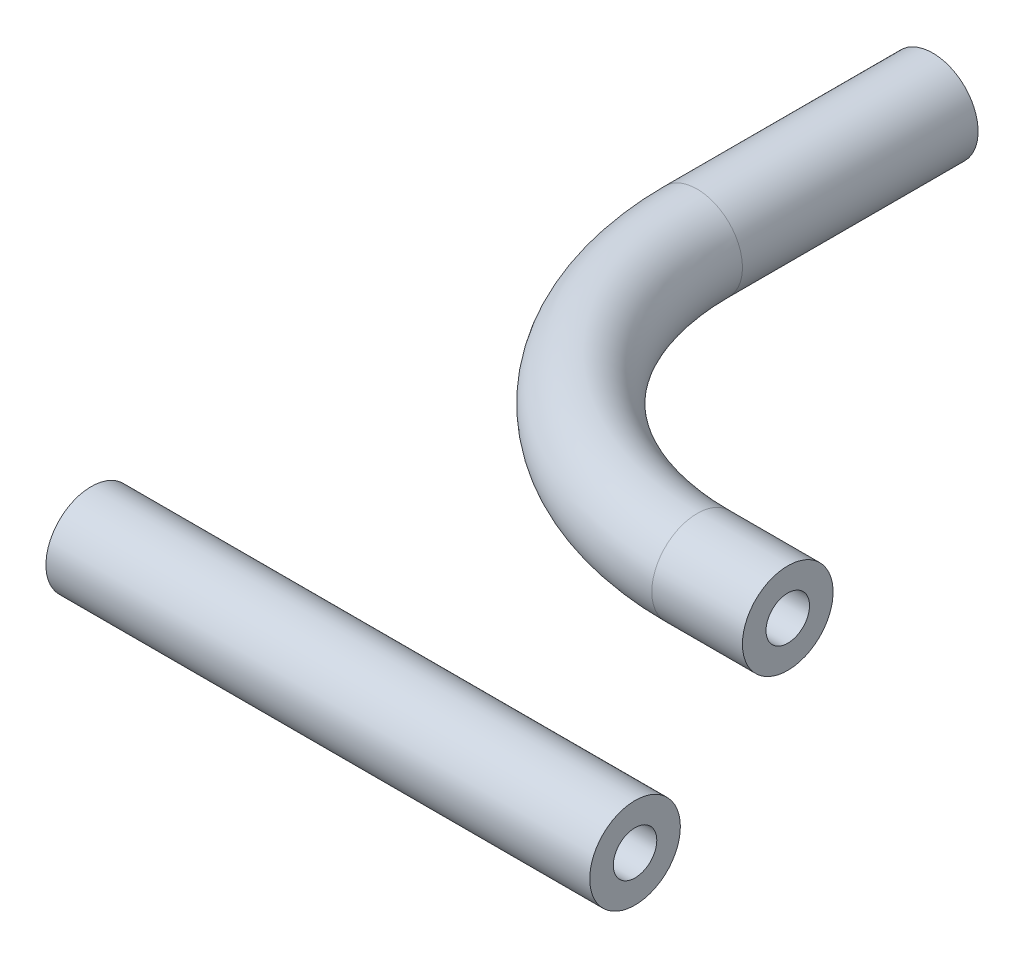
ISO-10303-21;
HEADER;
FILE_DESCRIPTION(('STEP AP214'),'2;1');
FILE_NAME('part.step','',(''),(''),'','','');
FILE_SCHEMA(('AUTOMOTIVE_DESIGN { 1 0 10303 214 1 1 1 1 }'));
ENDSEC;
DATA;
#1=APPLICATION_CONTEXT('core data for automotive mechanical design processes');
#2=APPLICATION_PROTOCOL_DEFINITION('international standard','automotive_design',2000,#1);
#3=PRODUCT_CONTEXT('',#1,'mechanical');
#4=PRODUCT('Part','Part','',(#3));
#5=PRODUCT_RELATED_PRODUCT_CATEGORY('part','',(#4));
#6=PRODUCT_DEFINITION_FORMATION('','',#4);
#7=PRODUCT_DEFINITION_CONTEXT('part definition',#1,'design');
#8=PRODUCT_DEFINITION('design','',#6,#7);
#9=PRODUCT_DEFINITION_SHAPE('','',#8);
#10=(LENGTH_UNIT() NAMED_UNIT(*) SI_UNIT(.MILLI.,.METRE.));
#11=(NAMED_UNIT(*) PLANE_ANGLE_UNIT() SI_UNIT($,.RADIAN.));
#12=(NAMED_UNIT(*) SI_UNIT($,.STERADIAN.) SOLID_ANGLE_UNIT());
#13=UNCERTAINTY_MEASURE_WITH_UNIT(LENGTH_MEASURE(1.E-05),#10,'distance_accuracy_value','');
#14=(GEOMETRIC_REPRESENTATION_CONTEXT(3) GLOBAL_UNCERTAINTY_ASSIGNED_CONTEXT((#13)) GLOBAL_UNIT_ASSIGNED_CONTEXT((#10,
#11,#12)) REPRESENTATION_CONTEXT('',''));
#15=CARTESIAN_POINT('',(0.,0.,0.));
#16=DIRECTION('',(0.,0.,1.));
#17=DIRECTION('',(1.,0.,0.));
#18=AXIS2_PLACEMENT_3D('',#15,#16,#17);
#19=CARTESIAN_POINT('',(38.1,0.,16.4145448021495));
#20=DIRECTION('',(1.,0.,0.));
#21=DIRECTION('',(0.,0.,-1.));
#22=AXIS2_PLACEMENT_3D('',#19,#20,#21);
#23=PLANE('',#22);
#24=CARTESIAN_POINT('',(38.1,0.,16.4145448021495));
#25=DIRECTION('',(1.,0.,0.));
#26=DIRECTION('',(0.,0.,-1.));
#27=AXIS2_PLACEMENT_3D('',#24,#25,#26);
#28=CIRCLE('',#27,3.175);
#29=CARTESIAN_POINT('',(38.1,0.,13.2395448021495));
#30=VERTEX_POINT('',#29);
#31=EDGE_CURVE('E11',#30,#30,#28,.T.);
#32=ORIENTED_EDGE('',*,*,#31,.T.);
#33=EDGE_LOOP('',(#32));
#34=FACE_BOUND('',#33,.T.);
#35=CARTESIAN_POINT('',(38.1,0.,16.4145448021495));
#36=DIRECTION('',(1.,0.,0.));
#37=DIRECTION('',(0.,0.,-1.));
#38=AXIS2_PLACEMENT_3D('',#35,#36,#37);
#39=CIRCLE('',#38,1.524);
#40=CARTESIAN_POINT('',(38.1,0.,14.8905448021495));
#41=VERTEX_POINT('',#40);
#42=EDGE_CURVE('E52',#41,#41,#39,.T.);
#43=ORIENTED_EDGE('',*,*,#42,.F.);
#44=EDGE_LOOP('',(#43));
#45=FACE_BOUND('',#44,.T.);
#46=ADVANCED_FACE('F41',(#34,#45),#23,.T.);
#47=CARTESIAN_POINT('',(0.,0.,16.4145448021495));
#48=DIRECTION('',(1.,0.,0.));
#49=DIRECTION('',(0.,0.,-1.));
#50=AXIS2_PLACEMENT_3D('',#47,#48,#49);
#51=PLANE('',#50);
#52=CARTESIAN_POINT('',(0.,0.,16.4145448021495));
#53=DIRECTION('',(1.,0.,0.));
#54=DIRECTION('',(0.,0.,-1.));
#55=AXIS2_PLACEMENT_3D('',#52,#53,#54);
#56=CIRCLE('',#55,3.175);
#57=CARTESIAN_POINT('',(0.,0.,13.2395448021495));
#58=VERTEX_POINT('',#57);
#59=EDGE_CURVE('E45',#58,#58,#56,.T.);
#60=ORIENTED_EDGE('',*,*,#59,.F.);
#61=EDGE_LOOP('',(#60));
#62=FACE_BOUND('',#61,.T.);
#63=CARTESIAN_POINT('',(0.,0.,16.4145448021495));
#64=DIRECTION('',(1.,0.,0.));
#65=DIRECTION('',(0.,0.,-1.));
#66=AXIS2_PLACEMENT_3D('',#63,#64,#65);
#67=CIRCLE('',#66,1.524);
#68=CARTESIAN_POINT('',(0.,0.,14.8905448021495));
#69=VERTEX_POINT('',#68);
#70=EDGE_CURVE('E54',#69,#69,#67,.T.);
#71=ORIENTED_EDGE('',*,*,#70,.T.);
#72=EDGE_LOOP('',(#71));
#73=FACE_BOUND('',#72,.T.);
#74=ADVANCED_FACE('F64',(#62,#73),#51,.F.);
#75=CARTESIAN_POINT('',(38.1,0.,16.4145448021495));
#76=DIRECTION('',(-1.,0.,0.));
#77=DIRECTION('',(0.,0.,1.));
#78=AXIS2_PLACEMENT_3D('',#75,#76,#77);
#79=CYLINDRICAL_SURFACE('',#78,3.175);
#80=ORIENTED_EDGE('',*,*,#31,.F.);
#81=EDGE_LOOP('',(#80));
#82=FACE_BOUND('',#81,.T.);
#83=ORIENTED_EDGE('',*,*,#59,.T.);
#84=EDGE_LOOP('',(#83));
#85=FACE_BOUND('',#84,.T.);
#86=ADVANCED_FACE('F43',(#82,#85),#79,.T.);
#87=CARTESIAN_POINT('',(38.1,0.,16.4145448021495));
#88=DIRECTION('',(-1.,0.,0.));
#89=DIRECTION('',(0.,0.,1.));
#90=AXIS2_PLACEMENT_3D('',#87,#88,#89);
#91=CYLINDRICAL_SURFACE('',#90,1.524);
#92=ORIENTED_EDGE('',*,*,#42,.T.);
#93=EDGE_LOOP('',(#92));
#94=FACE_BOUND('',#93,.T.);
#95=ORIENTED_EDGE('',*,*,#70,.F.);
#96=EDGE_LOOP('',(#95));
#97=FACE_BOUND('',#96,.T.);
#98=ADVANCED_FACE('F60',(#94,#97),#91,.F.);
#99=CLOSED_SHELL('',(#46,#74,#86,#98));
#100=MANIFOLD_SOLID_BREP('B2',#99);
#101=CARTESIAN_POINT('',(3.175,0.,-39.37));
#102=DIRECTION('',(0.,0.,1.));
#103=DIRECTION('',(1.,0.,0.));
#104=AXIS2_PLACEMENT_3D('',#101,#102,#103);
#105=CYLINDRICAL_SURFACE('',#104,3.175);
#106=CARTESIAN_POINT('',(3.175,0.,-22.8600000000002));
#107=DIRECTION('',(0.,0.,-1.));
#108=DIRECTION('',(-1.,0.,0.));
#109=AXIS2_PLACEMENT_3D('',#106,#107,#108);
#110=CIRCLE('',#109,3.175);
#111=CARTESIAN_POINT('',(0.,0.,-22.8600000000002));
#112=VERTEX_POINT('',#111);
#113=EDGE_CURVE('E169',#112,#112,#110,.T.);
#114=ORIENTED_EDGE('',*,*,#113,.T.);
#115=EDGE_LOOP('',(#114));
#116=FACE_BOUND('',#115,.T.);
#117=CARTESIAN_POINT('',(3.175,0.,-39.37));
#118=DIRECTION('',(0.,0.,-1.));
#119=DIRECTION('',(-1.,0.,0.));
#120=AXIS2_PLACEMENT_3D('',#117,#118,#119);
#121=CIRCLE('',#120,3.175);
#122=CARTESIAN_POINT('',(0.,0.,-39.37));
#123=VERTEX_POINT('',#122);
#124=EDGE_CURVE('E118',#123,#123,#121,.T.);
#125=ORIENTED_EDGE('',*,*,#124,.F.);
#126=EDGE_LOOP('',(#125));
#127=FACE_BOUND('',#126,.T.);
#128=ADVANCED_FACE('F103',(#116,#127),#105,.T.);
#129=CARTESIAN_POINT('',(22.86,0.,-22.86));
#130=DIRECTION('',(0.,1.,0.));
#131=DIRECTION('',(0.,0.,1.));
#132=AXIS2_PLACEMENT_3D('',#129,#130,#131);
#133=TOROIDAL_SURFACE('',#132,19.685,3.175);
#134=CARTESIAN_POINT('',(22.8600000000002,0.,-3.1749999999998));
#135=DIRECTION('',(-1.,0.,0.));
#136=DIRECTION('',(0.,0.,1.));
#137=AXIS2_PLACEMENT_3D('',#134,#135,#136);
#138=CIRCLE('',#137,3.175);
#139=CARTESIAN_POINT('',(22.8600000000002,0.,0.));
#140=VERTEX_POINT('',#139);
#141=EDGE_CURVE('E107',#140,#140,#138,.T.);
#142=CARTESIAN_POINT('',(22.86,0.,-22.86));
#143=DIRECTION('',(0.,1.,0.));
#144=DIRECTION('',(0.,0.,1.));
#145=AXIS2_PLACEMENT_3D('',#142,#143,#144);
#146=CIRCLE('',#145,22.86);
#147=EDGE_CURVE('',#112,#140,#146,.T.);
#148=ORIENTED_EDGE('',*,*,#113,.F.);
#149=ORIENTED_EDGE('',*,*,#141,.T.);
#150=ORIENTED_EDGE('',*,*,#147,.T.);
#151=ORIENTED_EDGE('',*,*,#147,.F.);
#152=EDGE_LOOP('',(#148,#150,#149,#151));
#153=FACE_BOUND('',#152,.T.);
#154=ADVANCED_FACE('F176',(#153),#133,.T.);
#155=CARTESIAN_POINT('',(22.8600000000002,0.,-3.175));
#156=DIRECTION('',(1.,0.,0.));
#157=DIRECTION('',(0.,0.,-1.));
#158=AXIS2_PLACEMENT_3D('',#155,#156,#157);
#159=CYLINDRICAL_SURFACE('',#158,3.175);
#160=CARTESIAN_POINT('',(29.21,0.,-3.175));
#161=DIRECTION('',(-1.,0.,0.));
#162=DIRECTION('',(0.,0.,1.));
#163=AXIS2_PLACEMENT_3D('',#160,#161,#162);
#164=CIRCLE('',#163,3.175);
#165=CARTESIAN_POINT('',(29.21,0.,0.));
#166=VERTEX_POINT('',#165);
#167=EDGE_CURVE('E123',#166,#166,#164,.T.);
#168=ORIENTED_EDGE('',*,*,#167,.T.);
#169=EDGE_LOOP('',(#168));
#170=FACE_BOUND('',#169,.T.);
#171=ORIENTED_EDGE('',*,*,#141,.F.);
#172=EDGE_LOOP('',(#171));
#173=FACE_BOUND('',#172,.T.);
#174=ADVANCED_FACE('F105',(#170,#173),#159,.T.);
#175=CARTESIAN_POINT('',(3.175,0.,-39.37));
#176=DIRECTION('',(0.,0.,-1.));
#177=DIRECTION('',(-1.,0.,0.));
#178=AXIS2_PLACEMENT_3D('',#175,#176,#177);
#179=PLANE('',#178);
#180=CARTESIAN_POINT('',(3.175,0.,-39.37));
#181=DIRECTION('',(0.,0.,-1.));
#182=DIRECTION('',(-1.,0.,0.));
#183=AXIS2_PLACEMENT_3D('',#180,#181,#182);
#184=CIRCLE('',#183,1.524);
#185=CARTESIAN_POINT('',(1.651,0.,-39.37));
#186=VERTEX_POINT('',#185);
#187=EDGE_CURVE('E162',#186,#186,#184,.F.);
#188=ORIENTED_EDGE('',*,*,#187,.T.);
#189=EDGE_LOOP('',(#188));
#190=FACE_BOUND('',#189,.T.);
#191=ORIENTED_EDGE('',*,*,#124,.T.);
#192=EDGE_LOOP('',(#191));
#193=FACE_BOUND('',#192,.T.);
#194=ADVANCED_FACE('F136',(#190,#193),#179,.T.);
#195=CARTESIAN_POINT('',(29.21,0.,-3.175));
#196=DIRECTION('',(-1.,0.,0.));
#197=DIRECTION('',(0.,0.,1.));
#198=AXIS2_PLACEMENT_3D('',#195,#196,#197);
#199=PLANE('',#198);
#200=CARTESIAN_POINT('',(29.21,0.,-3.175));
#201=DIRECTION('',(-1.,0.,0.));
#202=DIRECTION('',(0.,0.,1.));
#203=AXIS2_PLACEMENT_3D('',#200,#201,#202);
#204=CIRCLE('',#203,1.524);
#205=CARTESIAN_POINT('',(29.21,0.,-1.651));
#206=VERTEX_POINT('',#205);
#207=EDGE_CURVE('E39',#206,#206,#204,.F.);
#208=ORIENTED_EDGE('',*,*,#207,.F.);
#209=EDGE_LOOP('',(#208));
#210=FACE_BOUND('',#209,.T.);
#211=ORIENTED_EDGE('',*,*,#167,.F.);
#212=EDGE_LOOP('',(#211));
#213=FACE_BOUND('',#212,.T.);
#214=ADVANCED_FACE('F133',(#210,#213),#199,.F.);
#215=CARTESIAN_POINT('',(3.175,0.,-39.37));
#216=DIRECTION('',(0.,0.,1.));
#217=DIRECTION('',(1.,0.,0.));
#218=AXIS2_PLACEMENT_3D('',#215,#216,#217);
#219=CYLINDRICAL_SURFACE('',#218,1.524);
#220=CARTESIAN_POINT('',(3.175,0.,-22.8600000000002));
#221=DIRECTION('',(0.,0.,-1.));
#222=DIRECTION('',(-1.,0.,0.));
#223=AXIS2_PLACEMENT_3D('',#220,#221,#222);
#224=CIRCLE('',#223,1.524);
#225=CARTESIAN_POINT('',(1.651,0.,-22.8600000000002));
#226=VERTEX_POINT('',#225);
#227=EDGE_CURVE('E161',#226,#226,#224,.F.);
#228=ORIENTED_EDGE('',*,*,#227,.T.);
#229=EDGE_LOOP('',(#228));
#230=FACE_BOUND('',#229,.T.);
#231=ORIENTED_EDGE('',*,*,#187,.F.);
#232=EDGE_LOOP('',(#231));
#233=FACE_BOUND('',#232,.T.);
#234=ADVANCED_FACE('F135',(#230,#233),#219,.F.);
#235=CARTESIAN_POINT('',(22.86,0.,-22.86));
#236=DIRECTION('',(0.,1.,0.));
#237=DIRECTION('',(0.,0.,1.));
#238=AXIS2_PLACEMENT_3D('',#235,#236,#237);
#239=TOROIDAL_SURFACE('',#238,19.685,1.524);
#240=CARTESIAN_POINT('',(22.8600000000002,0.,-3.1749999999998));
#241=DIRECTION('',(-1.,0.,0.));
#242=DIRECTION('',(0.,0.,1.));
#243=AXIS2_PLACEMENT_3D('',#240,#241,#242);
#244=CIRCLE('',#243,1.524);
#245=CARTESIAN_POINT('',(22.8600000000002,0.,-1.651));
#246=VERTEX_POINT('',#245);
#247=EDGE_CURVE('E112',#246,#246,#244,.F.);
#248=CARTESIAN_POINT('',(22.86,0.,-22.86));
#249=DIRECTION('',(0.,1.,0.));
#250=DIRECTION('',(0.,0.,1.));
#251=AXIS2_PLACEMENT_3D('',#248,#249,#250);
#252=CIRCLE('',#251,21.209);
#253=EDGE_CURVE('',#226,#246,#252,.T.);
#254=ORIENTED_EDGE('',*,*,#227,.F.);
#255=ORIENTED_EDGE('',*,*,#247,.T.);
#256=ORIENTED_EDGE('',*,*,#253,.T.);
#257=ORIENTED_EDGE('',*,*,#253,.F.);
#258=EDGE_LOOP('',(#254,#256,#255,#257));
#259=FACE_BOUND('',#258,.T.);
#260=ADVANCED_FACE('F142',(#259),#239,.F.);
#261=CARTESIAN_POINT('',(22.8600000000002,0.,-3.175));
#262=DIRECTION('',(1.,0.,0.));
#263=DIRECTION('',(0.,0.,-1.));
#264=AXIS2_PLACEMENT_3D('',#261,#262,#263);
#265=CYLINDRICAL_SURFACE('',#264,1.524);
#266=ORIENTED_EDGE('',*,*,#207,.T.);
#267=EDGE_LOOP('',(#266));
#268=FACE_BOUND('',#267,.T.);
#269=ORIENTED_EDGE('',*,*,#247,.F.);
#270=EDGE_LOOP('',(#269));
#271=FACE_BOUND('',#270,.T.);
#272=ADVANCED_FACE('F130',(#268,#271),#265,.F.);
#273=CLOSED_SHELL('',(#128,#154,#174,#194,#214,#234,#260,#272));
#274=MANIFOLD_SOLID_BREP('B6',#273);
#275=ADVANCED_BREP_SHAPE_REPRESENTATION('',(#18,#100,#274),#14);
#276=SHAPE_DEFINITION_REPRESENTATION(#9,#275);
ENDSEC;
END-ISO-10303-21;
